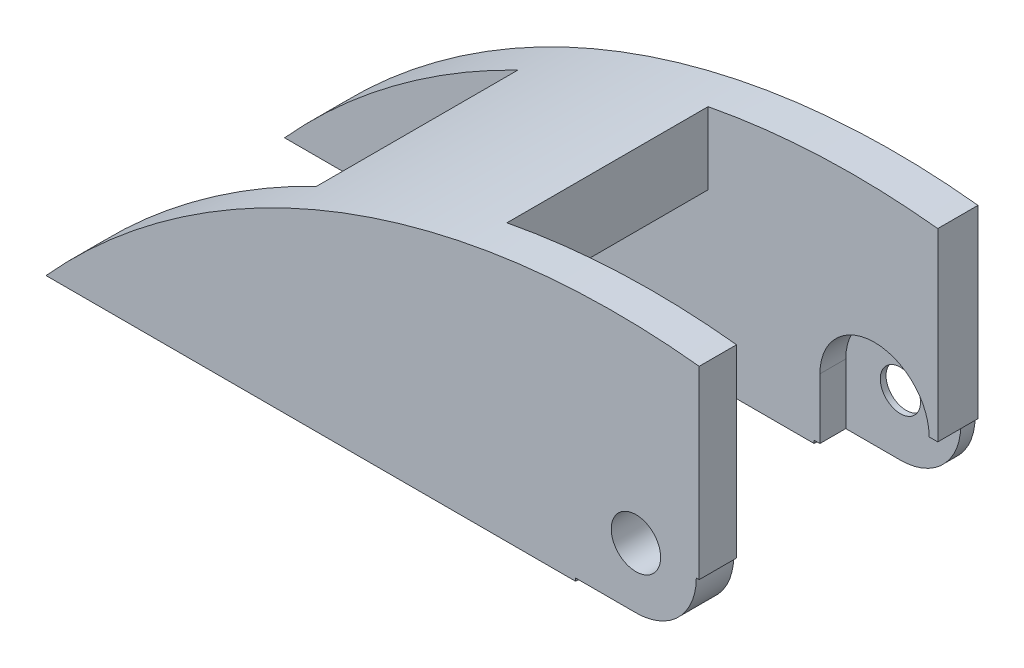
ISO-10303-21;
HEADER;
FILE_DESCRIPTION(('STEP AP214'),'2;1');
FILE_NAME('part.step','',(''),(''),'','','');
FILE_SCHEMA(('AUTOMOTIVE_DESIGN { 1 0 10303 214 1 1 1 1 }'));
ENDSEC;
DATA;
#1=APPLICATION_CONTEXT('core data for automotive mechanical design processes');
#2=APPLICATION_PROTOCOL_DEFINITION('international standard','automotive_design',2000,#1);
#3=PRODUCT_CONTEXT('',#1,'mechanical');
#4=PRODUCT('Part','Part','',(#3));
#5=PRODUCT_RELATED_PRODUCT_CATEGORY('part','',(#4));
#6=PRODUCT_DEFINITION_FORMATION('','',#4);
#7=PRODUCT_DEFINITION_CONTEXT('part definition',#1,'design');
#8=PRODUCT_DEFINITION('design','',#6,#7);
#9=PRODUCT_DEFINITION_SHAPE('','',#8);
#10=(LENGTH_UNIT() NAMED_UNIT(*) SI_UNIT(.MILLI.,.METRE.));
#11=(NAMED_UNIT(*) PLANE_ANGLE_UNIT() SI_UNIT($,.RADIAN.));
#12=(NAMED_UNIT(*) SI_UNIT($,.STERADIAN.) SOLID_ANGLE_UNIT());
#13=UNCERTAINTY_MEASURE_WITH_UNIT(LENGTH_MEASURE(1.E-05),#10,'distance_accuracy_value','');
#14=(GEOMETRIC_REPRESENTATION_CONTEXT(3) GLOBAL_UNCERTAINTY_ASSIGNED_CONTEXT((#13)) GLOBAL_UNIT_ASSIGNED_CONTEXT((#10,
#11,#12)) REPRESENTATION_CONTEXT('',''));
#15=CARTESIAN_POINT('',(0.,0.,0.));
#16=DIRECTION('',(0.,0.,1.));
#17=DIRECTION('',(1.,0.,0.));
#18=AXIS2_PLACEMENT_3D('',#15,#16,#17);
#19=CARTESIAN_POINT('',(0.,0.,0.));
#20=DIRECTION('',(0.,0.,-1.));
#21=DIRECTION('',(1.,0.,0.));
#22=AXIS2_PLACEMENT_3D('',#19,#20,#21);
#23=PLANE('',#22);
#24=DIRECTION('',(-1.,0.,0.));
#25=VECTOR('',#24,1.);
#26=CARTESIAN_POINT('',(0.,0.,0.));
#27=LINE('',#26,#25);
#28=CARTESIAN_POINT('',(11.,0.,0.));
#29=VERTEX_POINT('',#28);
#30=CARTESIAN_POINT('',(10.5,0.,0.));
#31=VERTEX_POINT('',#30);
#32=EDGE_CURVE('E313',#29,#31,#27,.T.);
#33=ORIENTED_EDGE('',*,*,#32,.T.);
#34=CARTESIAN_POINT('',(0.,0.,0.));
#35=DIRECTION('',(0.,0.,1.));
#36=DIRECTION('',(1.,0.,0.));
#37=AXIS2_PLACEMENT_3D('',#34,#35,#36);
#38=CIRCLE('',#37,10.5);
#39=CARTESIAN_POINT('',(0.,-10.5,0.));
#40=VERTEX_POINT('',#39);
#41=EDGE_CURVE('E326',#40,#31,#38,.T.);
#42=ORIENTED_EDGE('',*,*,#41,.F.);
#43=DIRECTION('',(-1.,0.,0.));
#44=VECTOR('',#43,1.);
#45=CARTESIAN_POINT('',(0.,-10.5,0.));
#46=LINE('',#45,#44);
#47=CARTESIAN_POINT('',(-10.5,-10.5,0.));
#48=VERTEX_POINT('',#47);
#49=EDGE_CURVE('E330',#40,#48,#46,.T.);
#50=ORIENTED_EDGE('',*,*,#49,.T.);
#51=DIRECTION('',(0.,-1.,0.));
#52=VECTOR('',#51,1.);
#53=CARTESIAN_POINT('',(-10.5,0.,0.));
#54=LINE('',#53,#52);
#55=CARTESIAN_POINT('',(-10.5,-11.,0.));
#56=VERTEX_POINT('',#55);
#57=EDGE_CURVE('E334',#48,#56,#54,.T.);
#58=ORIENTED_EDGE('',*,*,#57,.T.);
#59=DIRECTION('',(-1.,0.,0.));
#60=VECTOR('',#59,1.);
#61=CARTESIAN_POINT('',(0.,-11.,0.));
#62=LINE('',#61,#60);
#63=CARTESIAN_POINT('',(-102.62,-11.,0.));
#64=VERTEX_POINT('',#63);
#65=EDGE_CURVE('E433',#56,#64,#62,.T.);
#66=ORIENTED_EDGE('',*,*,#65,.T.);
#67=CARTESIAN_POINT('',(-3.65048090000549,-100.467657861413,0.));
#68=DIRECTION('',(0.,0.,1.));
#69=DIRECTION('',(-1.,0.,0.));
#70=AXIS2_PLACEMENT_3D('',#67,#68,#69);
#71=CIRCLE('',#70,133.414495142361);
#72=CARTESIAN_POINT('',(11.,32.14,0.));
#73=VERTEX_POINT('',#72);
#74=EDGE_CURVE('E390',#73,#64,#71,.T.);
#75=ORIENTED_EDGE('',*,*,#74,.F.);
#76=DIRECTION('',(0.,-1.,0.));
#77=VECTOR('',#76,1.);
#78=CARTESIAN_POINT('',(11.,0.,0.));
#79=LINE('',#78,#77);
#80=EDGE_CURVE('E442',#73,#29,#79,.T.);
#81=ORIENTED_EDGE('',*,*,#80,.T.);
#82=EDGE_LOOP('',(#33,#42,#50,#58,#66,#75,#81));
#83=FACE_BOUND('',#82,.T.);
#84=CARTESIAN_POINT('',(0.,0.,0.));
#85=DIRECTION('',(0.,0.,1.));
#86=DIRECTION('',(1.,0.,0.));
#87=AXIS2_PLACEMENT_3D('',#84,#85,#86);
#88=CIRCLE('',#87,6.);
#89=CARTESIAN_POINT('',(0.,-6.,0.));
#90=VERTEX_POINT('',#89);
#91=CARTESIAN_POINT('',(0.,6.,0.));
#92=VERTEX_POINT('',#91);
#93=EDGE_CURVE('E240',#90,#92,#88,.T.);
#94=ORIENTED_EDGE('',*,*,#93,.T.);
#95=DIRECTION('',(-1.,0.,0.));
#96=VECTOR('',#95,1.);
#97=CARTESIAN_POINT('',(0.,6.,0.));
#98=LINE('',#97,#96);
#99=CARTESIAN_POINT('',(-25.,6.,0.));
#100=VERTEX_POINT('',#99);
#101=EDGE_CURVE('E264',#92,#100,#98,.T.);
#102=ORIENTED_EDGE('',*,*,#101,.T.);
#103=DIRECTION('',(0.,-1.,0.));
#104=VECTOR('',#103,1.);
#105=CARTESIAN_POINT('',(-25.,0.,0.));
#106=LINE('',#105,#104);
#107=CARTESIAN_POINT('',(-25.,-6.,0.));
#108=VERTEX_POINT('',#107);
#109=EDGE_CURVE('E252',#100,#108,#106,.T.);
#110=ORIENTED_EDGE('',*,*,#109,.T.);
#111=DIRECTION('',(-1.,0.,0.));
#112=VECTOR('',#111,1.);
#113=CARTESIAN_POINT('',(0.,-6.,0.));
#114=LINE('',#113,#112);
#115=EDGE_CURVE('E259',#90,#108,#114,.T.);
#116=ORIENTED_EDGE('',*,*,#115,.F.);
#117=EDGE_LOOP('',(#94,#102,#110,#116));
#118=FACE_BOUND('',#117,.T.);
#119=ADVANCED_FACE('F49',(#83,#118),#23,.T.);
#120=CARTESIAN_POINT('',(0.,0.,21.75));
#121=DIRECTION('',(0.,0.,-1.));
#122=DIRECTION('',(1.,0.,0.));
#123=AXIS2_PLACEMENT_3D('',#120,#121,#122);
#124=CYLINDRICAL_SURFACE('',#123,3.5);
#125=CARTESIAN_POINT('',(0.,0.,2.5));
#126=DIRECTION('',(0.,0.,-1.));
#127=DIRECTION('',(0.,1.,0.));
#128=AXIS2_PLACEMENT_3D('',#125,#126,#127);
#129=CIRCLE('',#128,3.5);
#130=CARTESIAN_POINT('',(0.,3.5,2.5));
#131=VERTEX_POINT('',#130);
#132=EDGE_CURVE('E53',#131,#131,#129,.T.);
#133=ORIENTED_EDGE('',*,*,#132,.F.);
#134=EDGE_LOOP('',(#133));
#135=FACE_BOUND('',#134,.T.);
#136=CARTESIAN_POINT('',(0.,0.,1.5));
#137=DIRECTION('',(0.,0.,1.));
#138=DIRECTION('',(1.,0.,0.));
#139=AXIS2_PLACEMENT_3D('',#136,#137,#138);
#140=CIRCLE('',#139,3.5);
#141=CARTESIAN_POINT('',(3.5,0.,1.5));
#142=VERTEX_POINT('',#141);
#143=EDGE_CURVE('E248',#142,#142,#140,.F.);
#144=ORIENTED_EDGE('',*,*,#143,.T.);
#145=EDGE_LOOP('',(#144));
#146=FACE_BOUND('',#145,.T.);
#147=ADVANCED_FACE('F620',(#135,#146),#124,.F.);
#148=CARTESIAN_POINT('',(12.,-12.,7.));
#149=DIRECTION('',(0.,0.,-1.));
#150=DIRECTION('',(0.,-1.,0.));
#151=AXIS2_PLACEMENT_3D('',#148,#149,#150);
#152=PLANE('',#151);
#153=DIRECTION('',(-1.,0.,0.));
#154=VECTOR('',#153,1.);
#155=CARTESIAN_POINT('',(12.,0.,7.));
#156=LINE('',#155,#154);
#157=CARTESIAN_POINT('',(11.,0.,7.00000000000001));
#158=VERTEX_POINT('',#157);
#159=CARTESIAN_POINT('',(9.5,0.,7.));
#160=VERTEX_POINT('',#159);
#161=EDGE_CURVE('E365',#158,#160,#156,.T.);
#162=ORIENTED_EDGE('',*,*,#161,.F.);
#163=DIRECTION('',(0.,-1.,0.));
#164=VECTOR('',#163,1.);
#165=CARTESIAN_POINT('',(11.,-12.,7.));
#166=LINE('',#165,#164);
#167=CARTESIAN_POINT('',(11.,32.14,7.));
#168=VERTEX_POINT('',#167);
#169=EDGE_CURVE('E458',#168,#158,#166,.T.);
#170=ORIENTED_EDGE('',*,*,#169,.F.);
#171=CARTESIAN_POINT('',(-3.65048090000549,-100.467657861413,7.));
#172=DIRECTION('',(0.,0.,-1.));
#173=DIRECTION('',(-1.,0.,0.));
#174=AXIS2_PLACEMENT_3D('',#171,#172,#173);
#175=CIRCLE('',#174,133.414495142361);
#176=CARTESIAN_POINT('',(-28.9549396585655,30.5251353793884,7.));
#177=VERTEX_POINT('',#176);
#178=EDGE_CURVE('E478',#168,#177,#175,.F.);
#179=ORIENTED_EDGE('',*,*,#178,.T.);
#180=DIRECTION('',(0.,-1.,0.));
#181=VECTOR('',#180,1.);
#182=CARTESIAN_POINT('',(-28.9549396585655,38.5702227114121,7.));
#183=LINE('',#182,#181);
#184=CARTESIAN_POINT('',(-28.9549396585655,18.,7.));
#185=VERTEX_POINT('',#184);
#186=EDGE_CURVE('E369',#177,#185,#183,.T.);
#187=ORIENTED_EDGE('',*,*,#186,.T.);
#188=DIRECTION('',(1.,0.,0.));
#189=VECTOR('',#188,1.);
#190=CARTESIAN_POINT('',(0.,18.,7.));
#191=LINE('',#190,#189);
#192=CARTESIAN_POINT('',(-34.2965836217796,18.,6.99999999999999));
#193=VERTEX_POINT('',#192);
#194=EDGE_CURVE('E438',#193,#185,#191,.T.);
#195=ORIENTED_EDGE('',*,*,#194,.F.);
#196=CARTESIAN_POINT('',(11.,-91.4878048780488,6.99999999999999));
#197=DIRECTION('',(0.,0.,1.));
#198=DIRECTION('',(0.,-1.,0.));
#199=AXIS2_PLACEMENT_3D('',#196,#197,#198);
#200=CIRCLE('',#199,118.487804878049);
#201=CARTESIAN_POINT('',(-62.0435913010327,1.80739153991399,7.));
#202=VERTEX_POINT('',#201);
#203=EDGE_CURVE('E426',#193,#202,#200,.T.);
#204=ORIENTED_EDGE('',*,*,#203,.T.);
#205=DIRECTION('',(0.,1.,0.));
#206=VECTOR('',#205,1.);
#207=CARTESIAN_POINT('',(-62.0435913010327,-11.,7.));
#208=LINE('',#207,#206);
#209=CARTESIAN_POINT('',(-62.0435913010327,19.489301802395,7.));
#210=VERTEX_POINT('',#209);
#211=EDGE_CURVE('E373',#202,#210,#208,.T.);
#212=ORIENTED_EDGE('',*,*,#211,.T.);
#213=CARTESIAN_POINT('',(-3.65048090000549,-100.467657861413,7.));
#214=DIRECTION('',(0.,0.,-1.));
#215=DIRECTION('',(-1.,0.,0.));
#216=AXIS2_PLACEMENT_3D('',#213,#214,#215);
#217=CIRCLE('',#216,133.414495142361);
#218=CARTESIAN_POINT('',(-102.62,-11.,7.));
#219=VERTEX_POINT('',#218);
#220=EDGE_CURVE('E489',#210,#219,#217,.F.);
#221=ORIENTED_EDGE('',*,*,#220,.T.);
#222=DIRECTION('',(-1.,0.,0.));
#223=VECTOR('',#222,1.);
#224=CARTESIAN_POINT('',(0.,-11.,7.));
#225=LINE('',#224,#223);
#226=CARTESIAN_POINT('',(-10.5,-11.,7.00000000000001));
#227=VERTEX_POINT('',#226);
#228=EDGE_CURVE('E434',#227,#219,#225,.T.);
#229=ORIENTED_EDGE('',*,*,#228,.F.);
#230=DIRECTION('',(0.,-1.,0.));
#231=VECTOR('',#230,1.);
#232=CARTESIAN_POINT('',(-10.5,-12.,7.));
#233=LINE('',#232,#231);
#234=CARTESIAN_POINT('',(-10.5,-10.5,7.00000000000001));
#235=VERTEX_POINT('',#234);
#236=EDGE_CURVE('E361',#235,#227,#233,.T.);
#237=ORIENTED_EDGE('',*,*,#236,.F.);
#238=DIRECTION('',(-1.,0.,0.));
#239=VECTOR('',#238,1.);
#240=CARTESIAN_POINT('',(12.,-10.5,7.));
#241=LINE('',#240,#239);
#242=CARTESIAN_POINT('',(-9.5,-10.5,7.00000000000001));
#243=VERTEX_POINT('',#242);
#244=EDGE_CURVE('E344',#243,#235,#241,.T.);
#245=ORIENTED_EDGE('',*,*,#244,.F.);
#246=DIRECTION('',(0.,1.,0.));
#247=VECTOR('',#246,1.);
#248=CARTESIAN_POINT('',(-9.5,-12.,7.));
#249=LINE('',#248,#247);
#250=CARTESIAN_POINT('',(-9.5,0.,7.));
#251=VERTEX_POINT('',#250);
#252=EDGE_CURVE('E299',#243,#251,#249,.T.);
#253=ORIENTED_EDGE('',*,*,#252,.T.);
#254=CARTESIAN_POINT('',(0.,0.,7.));
#255=DIRECTION('',(0.,0.,-1.));
#256=DIRECTION('',(0.,1.,0.));
#257=AXIS2_PLACEMENT_3D('',#254,#255,#256);
#258=CIRCLE('',#257,9.5);
#259=EDGE_CURVE('E463',#251,#160,#258,.T.);
#260=ORIENTED_EDGE('',*,*,#259,.T.);
#261=EDGE_LOOP('',(#162,#170,#179,#187,#195,#204,#212,#221,#229,#237,#245,#253,#260));
#262=FACE_BOUND('',#261,.T.);
#263=ADVANCED_FACE('F558',(#262),#152,.F.);
#264=CARTESIAN_POINT('',(0.,0.,2.5));
#265=DIRECTION('',(0.,0.,1.));
#266=DIRECTION('',(0.,1.,0.));
#267=AXIS2_PLACEMENT_3D('',#264,#265,#266);
#268=CYLINDRICAL_SURFACE('',#267,9.5);
#269=DIRECTION('',(0.,0.,1.));
#270=VECTOR('',#269,1.);
#271=CARTESIAN_POINT('',(9.5,0.,2.5));
#272=LINE('',#271,#270);
#273=CARTESIAN_POINT('',(9.5,0.,2.5));
#274=VERTEX_POINT('',#273);
#275=EDGE_CURVE('E296',#274,#160,#272,.T.);
#276=ORIENTED_EDGE('',*,*,#275,.T.);
#277=ORIENTED_EDGE('',*,*,#259,.F.);
#278=DIRECTION('',(0.,0.,1.));
#279=VECTOR('',#278,1.);
#280=CARTESIAN_POINT('',(-9.5,0.,2.5));
#281=LINE('',#280,#279);
#282=CARTESIAN_POINT('',(-9.5,0.,2.5));
#283=VERTEX_POINT('',#282);
#284=EDGE_CURVE('E293',#283,#251,#281,.T.);
#285=ORIENTED_EDGE('',*,*,#284,.F.);
#286=CARTESIAN_POINT('',(0.,0.,2.5));
#287=DIRECTION('',(0.,0.,-1.));
#288=DIRECTION('',(0.,1.,0.));
#289=AXIS2_PLACEMENT_3D('',#286,#287,#288);
#290=CIRCLE('',#289,9.5);
#291=EDGE_CURVE('E462',#283,#274,#290,.T.);
#292=ORIENTED_EDGE('',*,*,#291,.T.);
#293=EDGE_LOOP('',(#276,#277,#285,#292));
#294=FACE_BOUND('',#293,.T.);
#295=ADVANCED_FACE('F616',(#294),#268,.F.);
#296=CARTESIAN_POINT('',(0.,-10.5,48.5));
#297=DIRECTION('',(0.,1.,0.));
#298=DIRECTION('',(0.,0.,-1.));
#299=AXIS2_PLACEMENT_3D('',#296,#297,#298);
#300=PLANE('',#299);
#301=DIRECTION('',(0.,0.,1.));
#302=VECTOR('',#301,1.);
#303=CARTESIAN_POINT('',(-9.5,-10.5,2.5));
#304=LINE('',#303,#302);
#305=CARTESIAN_POINT('',(-9.5,-10.5,2.5));
#306=VERTEX_POINT('',#305);
#307=EDGE_CURVE('E290',#306,#243,#304,.T.);
#308=ORIENTED_EDGE('',*,*,#307,.T.);
#309=ORIENTED_EDGE('',*,*,#244,.T.);
#310=DIRECTION('',(0.,0.,-1.));
#311=VECTOR('',#310,1.);
#312=CARTESIAN_POINT('',(-10.5,-10.5,48.5));
#313=LINE('',#312,#311);
#314=EDGE_CURVE('E354',#235,#48,#313,.T.);
#315=ORIENTED_EDGE('',*,*,#314,.T.);
#316=ORIENTED_EDGE('',*,*,#49,.F.);
#317=DIRECTION('',(0.,0.,-1.));
#318=VECTOR('',#317,1.);
#319=CARTESIAN_POINT('',(0.,-10.5,48.5));
#320=LINE('',#319,#318);
#321=CARTESIAN_POINT('',(0.,-10.5,2.50000000000002));
#322=VERTEX_POINT('',#321);
#323=EDGE_CURVE('E325',#322,#40,#320,.T.);
#324=ORIENTED_EDGE('',*,*,#323,.F.);
#325=DIRECTION('',(-1.,0.,0.));
#326=VECTOR('',#325,1.);
#327=CARTESIAN_POINT('',(0.,-10.5,2.5));
#328=LINE('',#327,#326);
#329=EDGE_CURVE('E278',#322,#306,#328,.T.);
#330=ORIENTED_EDGE('',*,*,#329,.T.);
#331=EDGE_LOOP('',(#308,#309,#315,#316,#324,#330));
#332=FACE_BOUND('',#331,.T.);
#333=ADVANCED_FACE('F574',(#332),#300,.F.);
#334=CARTESIAN_POINT('',(12.,18.,7.));
#335=DIRECTION('',(0.,1.,0.));
#336=DIRECTION('',(0.,0.,-1.));
#337=AXIS2_PLACEMENT_3D('',#334,#335,#336);
#338=PLANE('',#337);
#339=DIRECTION('',(0.,0.,1.));
#340=VECTOR('',#339,1.);
#341=CARTESIAN_POINT('',(-28.9549396585655,18.,7.));
#342=LINE('',#341,#340);
#343=CARTESIAN_POINT('',(-28.9549396585655,18.,42.));
#344=VERTEX_POINT('',#343);
#345=EDGE_CURVE('E378',#185,#344,#342,.T.);
#346=ORIENTED_EDGE('',*,*,#345,.T.);
#347=DIRECTION('',(-1.,0.,0.));
#348=VECTOR('',#347,1.);
#349=CARTESIAN_POINT('',(0.,18.,42.));
#350=LINE('',#349,#348);
#351=CARTESIAN_POINT('',(-34.2965836217796,18.,42.));
#352=VERTEX_POINT('',#351);
#353=EDGE_CURVE('E411',#344,#352,#350,.T.);
#354=ORIENTED_EDGE('',*,*,#353,.T.);
#355=DIRECTION('',(0.,0.,-1.));
#356=VECTOR('',#355,1.);
#357=CARTESIAN_POINT('',(-34.2965836217796,18.,41.5));
#358=LINE('',#357,#356);
#359=EDGE_CURVE('E423',#352,#193,#358,.T.);
#360=ORIENTED_EDGE('',*,*,#359,.T.);
#361=ORIENTED_EDGE('',*,*,#194,.T.);
#362=EDGE_LOOP('',(#346,#354,#360,#361));
#363=FACE_BOUND('',#362,.T.);
#364=ADVANCED_FACE('F608',(#363),#338,.F.);
#365=CARTESIAN_POINT('',(11.,0.,48.5));
#366=DIRECTION('',(-1.,0.,0.));
#367=DIRECTION('',(0.,0.,-1.));
#368=AXIS2_PLACEMENT_3D('',#365,#366,#367);
#369=PLANE('',#368);
#370=ORIENTED_EDGE('',*,*,#169,.T.);
#371=DIRECTION('',(0.,0.,-1.));
#372=VECTOR('',#371,1.);
#373=CARTESIAN_POINT('',(11.,0.,48.5));
#374=LINE('',#373,#372);
#375=EDGE_CURVE('E450',#158,#29,#374,.T.);
#376=ORIENTED_EDGE('',*,*,#375,.T.);
#377=ORIENTED_EDGE('',*,*,#80,.F.);
#378=DIRECTION('',(0.,0.,-1.));
#379=VECTOR('',#378,1.);
#380=CARTESIAN_POINT('',(11.,32.14,48.5));
#381=LINE('',#380,#379);
#382=EDGE_CURVE('E404',#168,#73,#381,.T.);
#383=ORIENTED_EDGE('',*,*,#382,.F.);
#384=EDGE_LOOP('',(#370,#376,#377,#383));
#385=FACE_BOUND('',#384,.T.);
#386=ADVANCED_FACE('F560',(#385),#369,.F.);
#387=CARTESIAN_POINT('',(0.,-11.,7.));
#388=DIRECTION('',(0.,1.,0.));
#389=DIRECTION('',(-1.,0.,0.));
#390=AXIS2_PLACEMENT_3D('',#387,#388,#389);
#391=PLANE('',#390);
#392=ORIENTED_EDGE('',*,*,#228,.T.);
#393=DIRECTION('',(0.,0.,-1.));
#394=VECTOR('',#393,1.);
#395=CARTESIAN_POINT('',(-102.62,-11.,48.5));
#396=LINE('',#395,#394);
#397=EDGE_CURVE('E398',#219,#64,#396,.T.);
#398=ORIENTED_EDGE('',*,*,#397,.T.);
#399=ORIENTED_EDGE('',*,*,#65,.F.);
#400=DIRECTION('',(0.,0.,-1.));
#401=VECTOR('',#400,1.);
#402=CARTESIAN_POINT('',(-10.5,-11.,48.5));
#403=LINE('',#402,#401);
#404=EDGE_CURVE('E350',#227,#56,#403,.T.);
#405=ORIENTED_EDGE('',*,*,#404,.F.);
#406=EDGE_LOOP('',(#392,#398,#399,#405));
#407=FACE_BOUND('',#406,.T.);
#408=ADVANCED_FACE('F596',(#407),#391,.F.);
#409=CARTESIAN_POINT('',(11.,-91.4878048780488,41.5));
#410=DIRECTION('',(0.,0.,-1.));
#411=DIRECTION('',(1.,0.,0.));
#412=AXIS2_PLACEMENT_3D('',#409,#410,#411);
#413=CYLINDRICAL_SURFACE('',#412,118.487804878049);
#414=DIRECTION('',(0.,0.,-1.));
#415=VECTOR('',#414,1.);
#416=CARTESIAN_POINT('',(-62.0435913010327,1.80739153991399,41.5));
#417=LINE('',#416,#415);
#418=CARTESIAN_POINT('',(-62.0435913010327,1.80739153991399,42.));
#419=VERTEX_POINT('',#418);
#420=EDGE_CURVE('E387',#419,#202,#417,.T.);
#421=ORIENTED_EDGE('',*,*,#420,.T.);
#422=ORIENTED_EDGE('',*,*,#203,.F.);
#423=ORIENTED_EDGE('',*,*,#359,.F.);
#424=CARTESIAN_POINT('',(11.,-91.4878048780488,42.));
#425=DIRECTION('',(0.,0.,1.));
#426=DIRECTION('',(1.,0.,0.));
#427=AXIS2_PLACEMENT_3D('',#424,#425,#426);
#428=CIRCLE('',#427,118.487804878049);
#429=EDGE_CURVE('E415',#352,#419,#428,.T.);
#430=ORIENTED_EDGE('',*,*,#429,.T.);
#431=EDGE_LOOP('',(#421,#422,#423,#430));
#432=FACE_BOUND('',#431,.T.);
#433=ADVANCED_FACE('F606',(#432),#413,.F.);
#434=CARTESIAN_POINT('',(-3.65048090000549,-100.467657861413,48.5));
#435=DIRECTION('',(0.,0.,-1.));
#436=DIRECTION('',(1.,0.,0.));
#437=AXIS2_PLACEMENT_3D('',#434,#435,#436);
#438=CYLINDRICAL_SURFACE('',#437,133.414495142361);
#439=DIRECTION('',(0.,0.,-1.));
#440=VECTOR('',#439,1.);
#441=CARTESIAN_POINT('',(-62.0435913010327,19.489301802395,48.5));
#442=LINE('',#441,#440);
#443=CARTESIAN_POINT('',(-62.0435913010327,19.489301802395,42.));
#444=VERTEX_POINT('',#443);
#445=EDGE_CURVE('E486',#444,#210,#442,.T.);
#446=ORIENTED_EDGE('',*,*,#445,.F.);
#447=CARTESIAN_POINT('',(-3.65048090000549,-100.467657861413,42.));
#448=DIRECTION('',(0.,0.,-1.));
#449=DIRECTION('',(-1.,0.,0.));
#450=AXIS2_PLACEMENT_3D('',#447,#448,#449);
#451=CIRCLE('',#450,133.414495142361);
#452=CARTESIAN_POINT('',(-102.62,-11.,42.));
#453=VERTEX_POINT('',#452);
#454=EDGE_CURVE('E482',#444,#453,#451,.F.);
#455=ORIENTED_EDGE('',*,*,#454,.T.);
#456=CARTESIAN_POINT('',(-102.62,-11.,48.5));
#457=VERTEX_POINT('',#456);
#458=EDGE_CURVE('E405',#457,#453,#396,.T.);
#459=ORIENTED_EDGE('',*,*,#458,.F.);
#460=CARTESIAN_POINT('',(-3.65048090000549,-100.467657861413,48.5));
#461=DIRECTION('',(0.,0.,1.));
#462=DIRECTION('',(-1.,0.,0.));
#463=AXIS2_PLACEMENT_3D('',#460,#461,#462);
#464=CIRCLE('',#463,133.414495142361);
#465=CARTESIAN_POINT('',(11.,32.14,48.5));
#466=VERTEX_POINT('',#465);
#467=EDGE_CURVE('E394',#466,#457,#464,.T.);
#468=ORIENTED_EDGE('',*,*,#467,.F.);
#469=CARTESIAN_POINT('',(11.,32.14,42.));
#470=VERTEX_POINT('',#469);
#471=EDGE_CURVE('E399',#466,#470,#381,.T.);
#472=ORIENTED_EDGE('',*,*,#471,.T.);
#473=CARTESIAN_POINT('',(-3.65048090000549,-100.467657861413,42.));
#474=DIRECTION('',(0.,0.,-1.));
#475=DIRECTION('',(-1.,0.,0.));
#476=AXIS2_PLACEMENT_3D('',#473,#474,#475);
#477=CIRCLE('',#476,133.414495142361);
#478=CARTESIAN_POINT('',(-28.9549396585655,30.5251353793884,42.));
#479=VERTEX_POINT('',#478);
#480=EDGE_CURVE('E467',#470,#479,#477,.F.);
#481=ORIENTED_EDGE('',*,*,#480,.T.);
#482=DIRECTION('',(0.,0.,-1.));
#483=VECTOR('',#482,1.);
#484=CARTESIAN_POINT('',(-28.9549396585655,30.5251353793883,48.5));
#485=LINE('',#484,#483);
#486=EDGE_CURVE('E474',#177,#479,#485,.F.);
#487=ORIENTED_EDGE('',*,*,#486,.F.);
#488=ORIENTED_EDGE('',*,*,#178,.F.);
#489=ORIENTED_EDGE('',*,*,#382,.T.);
#490=ORIENTED_EDGE('',*,*,#74,.T.);
#491=ORIENTED_EDGE('',*,*,#397,.F.);
#492=ORIENTED_EDGE('',*,*,#220,.F.);
#493=EDGE_LOOP('',(#446,#455,#459,#468,#472,#481,#487,#488,#489,#490,#491,#492));
#494=FACE_BOUND('',#493,.T.);
#495=ADVANCED_FACE('F520',(#494),#438,.T.);
#496=CARTESIAN_POINT('',(0.,0.,48.5));
#497=DIRECTION('',(0.,0.,1.));
#498=DIRECTION('',(-1.,0.,0.));
#499=AXIS2_PLACEMENT_3D('',#496,#497,#498);
#500=PLANE('',#499);
#501=CARTESIAN_POINT('',(0.,0.,48.5));
#502=DIRECTION('',(0.,0.,1.));
#503=DIRECTION('',(1.,0.,0.));
#504=AXIS2_PLACEMENT_3D('',#501,#502,#503);
#505=CIRCLE('',#504,4.3);
#506=CARTESIAN_POINT('',(4.3,0.,48.5));
#507=VERTEX_POINT('',#506);
#508=EDGE_CURVE('E303',#507,#507,#505,.T.);
#509=ORIENTED_EDGE('',*,*,#508,.F.);
#510=EDGE_LOOP('',(#509));
#511=FACE_BOUND('',#510,.T.);
#512=DIRECTION('',(-1.,0.,0.));
#513=VECTOR('',#512,1.);
#514=CARTESIAN_POINT('',(0.,0.,48.5));
#515=LINE('',#514,#513);
#516=CARTESIAN_POINT('',(11.,0.,48.5));
#517=VERTEX_POINT('',#516);
#518=CARTESIAN_POINT('',(10.5,0.,48.5));
#519=VERTEX_POINT('',#518);
#520=EDGE_CURVE('E321',#517,#519,#515,.T.);
#521=ORIENTED_EDGE('',*,*,#520,.F.);
#522=DIRECTION('',(0.,-1.,0.));
#523=VECTOR('',#522,1.);
#524=CARTESIAN_POINT('',(11.,0.,48.5));
#525=LINE('',#524,#523);
#526=EDGE_CURVE('E446',#466,#517,#525,.T.);
#527=ORIENTED_EDGE('',*,*,#526,.F.);
#528=ORIENTED_EDGE('',*,*,#467,.T.);
#529=DIRECTION('',(-1.,0.,0.));
#530=VECTOR('',#529,1.);
#531=CARTESIAN_POINT('',(0.,-11.,48.5));
#532=LINE('',#531,#530);
#533=CARTESIAN_POINT('',(-10.5,-11.,48.5));
#534=VERTEX_POINT('',#533);
#535=EDGE_CURVE('E430',#534,#457,#532,.T.);
#536=ORIENTED_EDGE('',*,*,#535,.F.);
#537=DIRECTION('',(0.,-1.,0.));
#538=VECTOR('',#537,1.);
#539=CARTESIAN_POINT('',(-10.5,0.,48.5));
#540=LINE('',#539,#538);
#541=CARTESIAN_POINT('',(-10.5,-10.5,48.5));
#542=VERTEX_POINT('',#541);
#543=EDGE_CURVE('E317',#542,#534,#540,.T.);
#544=ORIENTED_EDGE('',*,*,#543,.F.);
#545=DIRECTION('',(-1.,0.,0.));
#546=VECTOR('',#545,1.);
#547=CARTESIAN_POINT('',(0.,-10.5,48.5));
#548=LINE('',#547,#546);
#549=CARTESIAN_POINT('',(0.,-10.5,48.5));
#550=VERTEX_POINT('',#549);
#551=EDGE_CURVE('E312',#550,#542,#548,.T.);
#552=ORIENTED_EDGE('',*,*,#551,.F.);
#553=CARTESIAN_POINT('',(0.,0.,48.5));
#554=DIRECTION('',(0.,0.,1.));
#555=DIRECTION('',(1.,0.,0.));
#556=AXIS2_PLACEMENT_3D('',#553,#554,#555);
#557=CIRCLE('',#556,10.5);
#558=EDGE_CURVE('E308',#550,#519,#557,.T.);
#559=ORIENTED_EDGE('',*,*,#558,.T.);
#560=EDGE_LOOP('',(#521,#527,#528,#536,#544,#552,#559));
#561=FACE_BOUND('',#560,.T.);
#562=ADVANCED_FACE('F517',(#511,#561),#500,.T.);
#563=CARTESIAN_POINT('',(0.,0.,2.5));
#564=DIRECTION('',(0.,0.,1.));
#565=DIRECTION('',(0.,1.,0.));
#566=AXIS2_PLACEMENT_3D('',#563,#564,#565);
#567=PLANE('',#566);
#568=ORIENTED_EDGE('',*,*,#132,.T.);
#569=EDGE_LOOP('',(#568));
#570=FACE_BOUND('',#569,.T.);
#571=ORIENTED_EDGE('',*,*,#291,.F.);
#572=DIRECTION('',(0.,-1.,0.));
#573=VECTOR('',#572,1.);
#574=CARTESIAN_POINT('',(-9.5,0.,2.5));
#575=LINE('',#574,#573);
#576=EDGE_CURVE('E287',#283,#306,#575,.T.);
#577=ORIENTED_EDGE('',*,*,#576,.T.);
#578=ORIENTED_EDGE('',*,*,#329,.F.);
#579=CARTESIAN_POINT('',(0.,0.,2.5));
#580=DIRECTION('',(0.,0.,1.));
#581=DIRECTION('',(1.,0.,0.));
#582=AXIS2_PLACEMENT_3D('',#579,#580,#581);
#583=CIRCLE('',#582,10.5);
#584=CARTESIAN_POINT('',(10.5,0.,2.5));
#585=VERTEX_POINT('',#584);
#586=EDGE_CURVE('E75',#322,#585,#583,.T.);
#587=ORIENTED_EDGE('',*,*,#586,.T.);
#588=DIRECTION('',(-1.,0.,0.));
#589=VECTOR('',#588,1.);
#590=CARTESIAN_POINT('',(0.,0.,2.5));
#591=LINE('',#590,#589);
#592=EDGE_CURVE('E284',#585,#274,#591,.T.);
#593=ORIENTED_EDGE('',*,*,#592,.T.);
#594=EDGE_LOOP('',(#571,#577,#578,#587,#593));
#595=FACE_BOUND('',#594,.T.);
#596=ADVANCED_FACE('F51',(#570,#595),#567,.T.);
#597=ORIENTED_EDGE('',*,*,#471,.F.);
#598=ORIENTED_EDGE('',*,*,#526,.T.);
#599=CARTESIAN_POINT('',(11.,0.,42.));
#600=VERTEX_POINT('',#599);
#601=EDGE_CURVE('E454',#517,#600,#374,.T.);
#602=ORIENTED_EDGE('',*,*,#601,.T.);
#603=DIRECTION('',(0.,1.,0.));
#604=VECTOR('',#603,1.);
#605=CARTESIAN_POINT('',(11.,0.,42.));
#606=LINE('',#605,#604);
#607=EDGE_CURVE('E403',#600,#470,#606,.T.);
#608=ORIENTED_EDGE('',*,*,#607,.T.);
#609=EDGE_LOOP('',(#597,#598,#602,#608));
#610=FACE_BOUND('',#609,.T.);
#611=ADVANCED_FACE('F530',(#610),#369,.F.);
#612=ORIENTED_EDGE('',*,*,#535,.T.);
#613=ORIENTED_EDGE('',*,*,#458,.T.);
#614=DIRECTION('',(1.,0.,0.));
#615=VECTOR('',#614,1.);
#616=CARTESIAN_POINT('',(0.,-11.,42.));
#617=LINE('',#616,#615);
#618=CARTESIAN_POINT('',(-10.5,-11.,42.));
#619=VERTEX_POINT('',#618);
#620=EDGE_CURVE('E419',#453,#619,#617,.T.);
#621=ORIENTED_EDGE('',*,*,#620,.T.);
#622=EDGE_CURVE('E346',#534,#619,#403,.T.);
#623=ORIENTED_EDGE('',*,*,#622,.F.);
#624=EDGE_LOOP('',(#612,#613,#621,#623));
#625=FACE_BOUND('',#624,.T.);
#626=ADVANCED_FACE('F539',(#625),#391,.F.);
#627=CARTESIAN_POINT('',(0.,0.,42.));
#628=DIRECTION('',(0.,0.,-1.));
#629=DIRECTION('',(1.,0.,0.));
#630=AXIS2_PLACEMENT_3D('',#627,#628,#629);
#631=PLANE('',#630);
#632=CARTESIAN_POINT('',(0.,0.,42.));
#633=DIRECTION('',(0.,0.,1.));
#634=DIRECTION('',(1.,0.,0.));
#635=AXIS2_PLACEMENT_3D('',#632,#633,#634);
#636=CIRCLE('',#635,4.3);
#637=CARTESIAN_POINT('',(4.3,0.,42.));
#638=VERTEX_POINT('',#637);
#639=EDGE_CURVE('E307',#638,#638,#636,.T.);
#640=ORIENTED_EDGE('',*,*,#639,.T.);
#641=EDGE_LOOP('',(#640));
#642=FACE_BOUND('',#641,.T.);
#643=DIRECTION('',(-1.,0.,0.));
#644=VECTOR('',#643,1.);
#645=CARTESIAN_POINT('',(0.,0.,42.));
#646=LINE('',#645,#644);
#647=CARTESIAN_POINT('',(10.5,0.,42.));
#648=VERTEX_POINT('',#647);
#649=EDGE_CURVE('E11',#600,#648,#646,.T.);
#650=ORIENTED_EDGE('',*,*,#649,.T.);
#651=CARTESIAN_POINT('',(0.,0.,42.));
#652=DIRECTION('',(0.,0.,1.));
#653=DIRECTION('',(1.,0.,0.));
#654=AXIS2_PLACEMENT_3D('',#651,#652,#653);
#655=CIRCLE('',#654,10.5);
#656=CARTESIAN_POINT('',(0.,-10.5,42.));
#657=VERTEX_POINT('',#656);
#658=EDGE_CURVE('E59',#657,#648,#655,.T.);
#659=ORIENTED_EDGE('',*,*,#658,.F.);
#660=DIRECTION('',(-1.,0.,0.));
#661=VECTOR('',#660,1.);
#662=CARTESIAN_POINT('',(0.,-10.5,42.));
#663=LINE('',#662,#661);
#664=CARTESIAN_POINT('',(-10.5,-10.5,42.));
#665=VERTEX_POINT('',#664);
#666=EDGE_CURVE('E493',#657,#665,#663,.T.);
#667=ORIENTED_EDGE('',*,*,#666,.T.);
#668=DIRECTION('',(0.,-1.,0.));
#669=VECTOR('',#668,1.);
#670=CARTESIAN_POINT('',(-10.5,0.,42.));
#671=LINE('',#670,#669);
#672=EDGE_CURVE('E497',#665,#619,#671,.T.);
#673=ORIENTED_EDGE('',*,*,#672,.T.);
#674=ORIENTED_EDGE('',*,*,#620,.F.);
#675=ORIENTED_EDGE('',*,*,#454,.F.);
#676=DIRECTION('',(0.,1.,0.));
#677=VECTOR('',#676,1.);
#678=CARTESIAN_POINT('',(-62.0435913010327,-11.,42.));
#679=LINE('',#678,#677);
#680=EDGE_CURVE('E370',#419,#444,#679,.T.);
#681=ORIENTED_EDGE('',*,*,#680,.F.);
#682=ORIENTED_EDGE('',*,*,#429,.F.);
#683=ORIENTED_EDGE('',*,*,#353,.F.);
#684=DIRECTION('',(0.,-1.,0.));
#685=VECTOR('',#684,1.);
#686=CARTESIAN_POINT('',(-28.9549396585655,38.5702227114121,42.));
#687=LINE('',#686,#685);
#688=EDGE_CURVE('E374',#479,#344,#687,.T.);
#689=ORIENTED_EDGE('',*,*,#688,.F.);
#690=ORIENTED_EDGE('',*,*,#480,.F.);
#691=ORIENTED_EDGE('',*,*,#607,.F.);
#692=EDGE_LOOP('',(#650,#659,#667,#673,#674,#675,#681,#682,#683,#689,#690,#691));
#693=FACE_BOUND('',#692,.T.);
#694=ADVANCED_FACE('F506',(#642,#693),#631,.T.);
#695=CARTESIAN_POINT('',(-28.9549396585655,38.5702227114121,7.));
#696=DIRECTION('',(1.,0.,0.));
#697=DIRECTION('',(0.,0.,1.));
#698=AXIS2_PLACEMENT_3D('',#695,#696,#697);
#699=PLANE('',#698);
#700=ORIENTED_EDGE('',*,*,#345,.F.);
#701=ORIENTED_EDGE('',*,*,#186,.F.);
#702=ORIENTED_EDGE('',*,*,#486,.T.);
#703=ORIENTED_EDGE('',*,*,#688,.T.);
#704=EDGE_LOOP('',(#700,#701,#702,#703));
#705=FACE_BOUND('',#704,.T.);
#706=ADVANCED_FACE('F554',(#705),#699,.T.);
#707=CARTESIAN_POINT('',(-62.0435913010327,-11.,7.));
#708=DIRECTION('',(-1.,0.,0.));
#709=DIRECTION('',(0.,0.,-1.));
#710=AXIS2_PLACEMENT_3D('',#707,#708,#709);
#711=PLANE('',#710);
#712=ORIENTED_EDGE('',*,*,#420,.F.);
#713=ORIENTED_EDGE('',*,*,#680,.T.);
#714=ORIENTED_EDGE('',*,*,#445,.T.);
#715=ORIENTED_EDGE('',*,*,#211,.F.);
#716=EDGE_LOOP('',(#712,#713,#714,#715));
#717=FACE_BOUND('',#716,.T.);
#718=ADVANCED_FACE('F602',(#717),#711,.T.);
#719=CARTESIAN_POINT('',(0.,0.,48.5));
#720=DIRECTION('',(0.,1.,0.));
#721=DIRECTION('',(0.,0.,-1.));
#722=AXIS2_PLACEMENT_3D('',#719,#720,#721);
#723=PLANE('',#722);
#724=ORIENTED_EDGE('',*,*,#649,.F.);
#725=ORIENTED_EDGE('',*,*,#601,.F.);
#726=ORIENTED_EDGE('',*,*,#520,.T.);
#727=DIRECTION('',(0.,0.,-1.));
#728=VECTOR('',#727,1.);
#729=CARTESIAN_POINT('',(10.5,0.,48.5));
#730=LINE('',#729,#728);
#731=EDGE_CURVE('E341',#519,#648,#730,.T.);
#732=ORIENTED_EDGE('',*,*,#731,.T.);
#733=EDGE_LOOP('',(#724,#725,#726,#732));
#734=FACE_BOUND('',#733,.T.);
#735=ADVANCED_FACE('F527',(#734),#723,.F.);
#736=ORIENTED_EDGE('',*,*,#666,.F.);
#737=EDGE_CURVE('E355',#550,#657,#320,.T.);
#738=ORIENTED_EDGE('',*,*,#737,.F.);
#739=ORIENTED_EDGE('',*,*,#551,.T.);
#740=EDGE_CURVE('E351',#542,#665,#313,.T.);
#741=ORIENTED_EDGE('',*,*,#740,.T.);
#742=EDGE_LOOP('',(#736,#738,#739,#741));
#743=FACE_BOUND('',#742,.T.);
#744=ADVANCED_FACE('F545',(#743),#300,.F.);
#745=CARTESIAN_POINT('',(-10.5,0.,48.5));
#746=DIRECTION('',(-1.,0.,0.));
#747=DIRECTION('',(0.,0.,-1.));
#748=AXIS2_PLACEMENT_3D('',#745,#746,#747);
#749=PLANE('',#748);
#750=ORIENTED_EDGE('',*,*,#672,.F.);
#751=ORIENTED_EDGE('',*,*,#740,.F.);
#752=ORIENTED_EDGE('',*,*,#543,.T.);
#753=ORIENTED_EDGE('',*,*,#622,.T.);
#754=EDGE_LOOP('',(#750,#751,#752,#753));
#755=FACE_BOUND('',#754,.T.);
#756=ADVANCED_FACE('F542',(#755),#749,.F.);
#757=CARTESIAN_POINT('',(0.,0.,48.5));
#758=DIRECTION('',(0.,0.,-1.));
#759=DIRECTION('',(1.,0.,0.));
#760=AXIS2_PLACEMENT_3D('',#757,#758,#759);
#761=CYLINDRICAL_SURFACE('',#760,10.5);
#762=ORIENTED_EDGE('',*,*,#737,.T.);
#763=ORIENTED_EDGE('',*,*,#658,.T.);
#764=ORIENTED_EDGE('',*,*,#731,.F.);
#765=ORIENTED_EDGE('',*,*,#558,.F.);
#766=EDGE_LOOP('',(#762,#763,#764,#765));
#767=FACE_BOUND('',#766,.T.);
#768=ADVANCED_FACE('F548',(#767),#761,.T.);
#769=ORIENTED_EDGE('',*,*,#586,.F.);
#770=ORIENTED_EDGE('',*,*,#323,.T.);
#771=ORIENTED_EDGE('',*,*,#41,.T.);
#772=EDGE_CURVE('E345',#585,#31,#730,.T.);
#773=ORIENTED_EDGE('',*,*,#772,.F.);
#774=EDGE_LOOP('',(#769,#770,#771,#773));
#775=FACE_BOUND('',#774,.T.);
#776=ADVANCED_FACE('F571',(#775),#761,.T.);
#777=ORIENTED_EDGE('',*,*,#375,.F.);
#778=ORIENTED_EDGE('',*,*,#161,.T.);
#779=ORIENTED_EDGE('',*,*,#275,.F.);
#780=ORIENTED_EDGE('',*,*,#592,.F.);
#781=ORIENTED_EDGE('',*,*,#772,.T.);
#782=ORIENTED_EDGE('',*,*,#32,.F.);
#783=EDGE_LOOP('',(#777,#778,#779,#780,#781,#782));
#784=FACE_BOUND('',#783,.T.);
#785=ADVANCED_FACE('F580',(#784),#723,.F.);
#786=ORIENTED_EDGE('',*,*,#314,.F.);
#787=ORIENTED_EDGE('',*,*,#236,.T.);
#788=ORIENTED_EDGE('',*,*,#404,.T.);
#789=ORIENTED_EDGE('',*,*,#57,.F.);
#790=EDGE_LOOP('',(#786,#787,#788,#789));
#791=FACE_BOUND('',#790,.T.);
#792=ADVANCED_FACE('F513',(#791),#749,.F.);
#793=CARTESIAN_POINT('',(0.,0.,48.5));
#794=DIRECTION('',(0.,0.,-1.));
#795=DIRECTION('',(1.,0.,0.));
#796=AXIS2_PLACEMENT_3D('',#793,#794,#795);
#797=CYLINDRICAL_SURFACE('',#796,4.3);
#798=CARTESIAN_POINT('',(4.3,0.,42.));
#799=CARTESIAN_POINT('',(4.3,0.,42.0677083333333));
#800=CARTESIAN_POINT('',(4.3,0.,42.1354166666667));
#801=CARTESIAN_POINT('',(4.3,0.,42.2708333333333));
#802=CARTESIAN_POINT('',(4.3,0.,42.3385416666667));
#803=CARTESIAN_POINT('',(4.3,0.,42.4739583333333));
#804=CARTESIAN_POINT('',(4.3,0.,42.5416666666667));
#805=CARTESIAN_POINT('',(4.3,0.,42.6770833333333));
#806=CARTESIAN_POINT('',(4.3,0.,42.7447916666667));
#807=CARTESIAN_POINT('',(4.3,0.,42.8802083333333));
#808=CARTESIAN_POINT('',(4.3,0.,42.9479166666667));
#809=CARTESIAN_POINT('',(4.3,0.,43.0833333333333));
#810=CARTESIAN_POINT('',(4.3,0.,43.1510416666667));
#811=CARTESIAN_POINT('',(4.3,0.,43.2864583333333));
#812=CARTESIAN_POINT('',(4.3,0.,43.3541666666667));
#813=CARTESIAN_POINT('',(4.3,0.,43.4895833333333));
#814=CARTESIAN_POINT('',(4.3,0.,43.5572916666667));
#815=CARTESIAN_POINT('',(4.3,0.,43.6927083333333));
#816=CARTESIAN_POINT('',(4.3,0.,43.7604166666667));
#817=CARTESIAN_POINT('',(4.3,0.,43.8958333333333));
#818=CARTESIAN_POINT('',(4.3,0.,43.9635416666667));
#819=CARTESIAN_POINT('',(4.3,0.,44.0989583333333));
#820=CARTESIAN_POINT('',(4.3,0.,44.1666666666667));
#821=CARTESIAN_POINT('',(4.3,0.,44.3020833333333));
#822=CARTESIAN_POINT('',(4.3,0.,44.3697916666667));
#823=CARTESIAN_POINT('',(4.3,0.,44.5052083333333));
#824=CARTESIAN_POINT('',(4.3,0.,44.5729166666667));
#825=CARTESIAN_POINT('',(4.3,0.,44.7083333333333));
#826=CARTESIAN_POINT('',(4.3,0.,44.7760416666667));
#827=CARTESIAN_POINT('',(4.3,0.,44.9114583333333));
#828=CARTESIAN_POINT('',(4.3,0.,44.9791666666667));
#829=CARTESIAN_POINT('',(4.3,0.,45.1145833333333));
#830=CARTESIAN_POINT('',(4.3,0.,45.1822916666667));
#831=CARTESIAN_POINT('',(4.3,0.,45.3177083333333));
#832=CARTESIAN_POINT('',(4.3,0.,45.3854166666667));
#833=CARTESIAN_POINT('',(4.3,0.,45.5208333333333));
#834=CARTESIAN_POINT('',(4.3,0.,45.5885416666667));
#835=CARTESIAN_POINT('',(4.3,0.,45.7239583333333));
#836=CARTESIAN_POINT('',(4.3,0.,45.7916666666667));
#837=CARTESIAN_POINT('',(4.3,0.,45.9270833333333));
#838=CARTESIAN_POINT('',(4.3,0.,45.9947916666667));
#839=CARTESIAN_POINT('',(4.3,0.,46.1302083333333));
#840=CARTESIAN_POINT('',(4.3,0.,46.1979166666667));
#841=CARTESIAN_POINT('',(4.3,0.,46.3333333333333));
#842=CARTESIAN_POINT('',(4.3,0.,46.4010416666667));
#843=CARTESIAN_POINT('',(4.3,0.,46.5364583333333));
#844=CARTESIAN_POINT('',(4.3,0.,46.6041666666667));
#845=CARTESIAN_POINT('',(4.3,0.,46.7395833333333));
#846=CARTESIAN_POINT('',(4.3,0.,46.8072916666667));
#847=CARTESIAN_POINT('',(4.3,0.,46.9427083333333));
#848=CARTESIAN_POINT('',(4.3,0.,47.0104166666667));
#849=CARTESIAN_POINT('',(4.3,0.,47.1458333333333));
#850=CARTESIAN_POINT('',(4.3,0.,47.2135416666667));
#851=CARTESIAN_POINT('',(4.3,0.,47.3489583333333));
#852=CARTESIAN_POINT('',(4.3,0.,47.4166666666667));
#853=CARTESIAN_POINT('',(4.3,0.,47.5520833333333));
#854=CARTESIAN_POINT('',(4.3,0.,47.6197916666667));
#855=CARTESIAN_POINT('',(4.3,0.,47.7552083333333));
#856=CARTESIAN_POINT('',(4.3,0.,47.8229166666667));
#857=CARTESIAN_POINT('',(4.3,0.,47.9583333333333));
#858=CARTESIAN_POINT('',(4.3,0.,48.0260416666667));
#859=CARTESIAN_POINT('',(4.3,0.,48.1614583333333));
#860=CARTESIAN_POINT('',(4.3,0.,48.2291666666667));
#861=CARTESIAN_POINT('',(4.3,0.,48.3645833333333));
#862=CARTESIAN_POINT('',(4.3,0.,48.4322916666667));
#863=CARTESIAN_POINT('',(4.3,0.,48.5));
#864=B_SPLINE_CURVE_WITH_KNOTS('',3,(#798,#799,#800,#801,#802,#803,#804,#805,#806,#807,#808,
#809,#810,#811,#812,#813,#814,#815,#816,#817,#818,#819,#820,#821,#822,#823,#824,#825,#826,#827,
#828,#829,#830,#831,#832,#833,#834,#835,#836,#837,#838,#839,#840,#841,#842,#843,#844,#845,#846,
#847,#848,#849,#850,#851,#852,#853,#854,#855,#856,#857,#858,#859,#860,#861,#862,#863),
.UNSPECIFIED.,.F.,.F.,(4,2,2,2,2,2,2,2,2,2,2,2,2,2,2,2,2,2,2,2,2,2,2,2,2,2,2,2,2,2,2,2,4),(0.,
0.203124999999998,0.406249999999997,0.609374999999995,0.812500000000001,1.015625,1.21875,
1.421875,1.62499999999999,1.828125,2.03125,2.234375,2.4375,2.64062499999999,2.84375,3.046875,
3.25,3.45312499999999,3.65624999999999,3.859375,4.0625,4.26562499999999,4.46874999999999,
4.671875,4.875,5.078125,5.28124999999999,5.48437499999999,5.6875,5.890625,6.09374999999999,
6.29687499999999,6.5),.UNSPECIFIED.);
#865=EDGE_CURVE('BSEAM509',#638,#507,#864,.T.);
#866=ORIENTED_EDGE('',*,*,#639,.F.);
#867=ORIENTED_EDGE('',*,*,#508,.T.);
#868=ORIENTED_EDGE('',*,*,#865,.T.);
#869=ORIENTED_EDGE('',*,*,#865,.F.);
#870=EDGE_LOOP('',(#866,#868,#867,#869));
#871=FACE_BOUND('',#870,.T.);
#872=ADVANCED_FACE('F509',(#871),#797,.F.);
#873=CARTESIAN_POINT('',(-9.5,0.,2.5));
#874=DIRECTION('',(1.,0.,0.));
#875=DIRECTION('',(0.,0.,1.));
#876=AXIS2_PLACEMENT_3D('',#873,#874,#875);
#877=PLANE('',#876);
#878=ORIENTED_EDGE('',*,*,#252,.F.);
#879=ORIENTED_EDGE('',*,*,#307,.F.);
#880=ORIENTED_EDGE('',*,*,#576,.F.);
#881=ORIENTED_EDGE('',*,*,#284,.T.);
#882=EDGE_LOOP('',(#878,#879,#880,#881));
#883=FACE_BOUND('',#882,.T.);
#884=ADVANCED_FACE('F512',(#883),#877,.T.);
#885=CARTESIAN_POINT('',(0.,-6.,1.5));
#886=DIRECTION('',(0.,1.,0.));
#887=DIRECTION('',(-1.,0.,0.));
#888=AXIS2_PLACEMENT_3D('',#885,#886,#887);
#889=PLANE('',#888);
#890=ORIENTED_EDGE('',*,*,#115,.T.);
#891=DIRECTION('',(0.,0.,-1.));
#892=VECTOR('',#891,1.);
#893=CARTESIAN_POINT('',(-25.,-6.,1.5));
#894=LINE('',#893,#892);
#895=CARTESIAN_POINT('',(-25.,-6.,1.5));
#896=VERTEX_POINT('',#895);
#897=EDGE_CURVE('E246',#896,#108,#894,.T.);
#898=ORIENTED_EDGE('',*,*,#897,.F.);
#899=DIRECTION('',(-1.,0.,0.));
#900=VECTOR('',#899,1.);
#901=CARTESIAN_POINT('',(0.,-6.,1.5));
#902=LINE('',#901,#900);
#903=CARTESIAN_POINT('',(0.,-6.,1.5));
#904=VERTEX_POINT('',#903);
#905=EDGE_CURVE('E230',#904,#896,#902,.T.);
#906=ORIENTED_EDGE('',*,*,#905,.F.);
#907=DIRECTION('',(0.,0.,-1.));
#908=VECTOR('',#907,1.);
#909=CARTESIAN_POINT('',(0.,-6.,1.5));
#910=LINE('',#909,#908);
#911=EDGE_CURVE('E67',#904,#90,#910,.T.);
#912=ORIENTED_EDGE('',*,*,#911,.T.);
#913=EDGE_LOOP('',(#890,#898,#906,#912));
#914=FACE_BOUND('',#913,.T.);
#915=ADVANCED_FACE('F245',(#914),#889,.T.);
#916=CARTESIAN_POINT('',(-25.,0.,1.5));
#917=DIRECTION('',(-1.,0.,0.));
#918=DIRECTION('',(0.,0.,-1.));
#919=AXIS2_PLACEMENT_3D('',#916,#917,#918);
#920=PLANE('',#919);
#921=ORIENTED_EDGE('',*,*,#109,.F.);
#922=DIRECTION('',(0.,0.,-1.));
#923=VECTOR('',#922,1.);
#924=CARTESIAN_POINT('',(-25.,6.,1.5));
#925=LINE('',#924,#923);
#926=CARTESIAN_POINT('',(-25.,6.,1.5));
#927=VERTEX_POINT('',#926);
#928=EDGE_CURVE('E273',#927,#100,#925,.T.);
#929=ORIENTED_EDGE('',*,*,#928,.F.);
#930=DIRECTION('',(0.,-1.,0.));
#931=VECTOR('',#930,1.);
#932=CARTESIAN_POINT('',(-25.,0.,1.5));
#933=LINE('',#932,#931);
#934=EDGE_CURVE('E243',#927,#896,#933,.T.);
#935=ORIENTED_EDGE('',*,*,#934,.T.);
#936=ORIENTED_EDGE('',*,*,#897,.T.);
#937=EDGE_LOOP('',(#921,#929,#935,#936));
#938=FACE_BOUND('',#937,.T.);
#939=ADVANCED_FACE('F893',(#938),#920,.F.);
#940=CARTESIAN_POINT('',(0.,6.,1.5));
#941=DIRECTION('',(0.,1.,0.));
#942=DIRECTION('',(-1.,0.,0.));
#943=AXIS2_PLACEMENT_3D('',#940,#941,#942);
#944=PLANE('',#943);
#945=ORIENTED_EDGE('',*,*,#101,.F.);
#946=DIRECTION('',(0.,0.,-1.));
#947=VECTOR('',#946,1.);
#948=CARTESIAN_POINT('',(0.,6.,1.5));
#949=LINE('',#948,#947);
#950=CARTESIAN_POINT('',(0.,6.,1.5));
#951=VERTEX_POINT('',#950);
#952=EDGE_CURVE('E242',#951,#92,#949,.T.);
#953=ORIENTED_EDGE('',*,*,#952,.F.);
#954=DIRECTION('',(-1.,0.,0.));
#955=VECTOR('',#954,1.);
#956=CARTESIAN_POINT('',(0.,6.,1.5));
#957=LINE('',#956,#955);
#958=EDGE_CURVE('E232',#951,#927,#957,.T.);
#959=ORIENTED_EDGE('',*,*,#958,.T.);
#960=ORIENTED_EDGE('',*,*,#928,.T.);
#961=EDGE_LOOP('',(#945,#953,#959,#960));
#962=FACE_BOUND('',#961,.T.);
#963=ADVANCED_FACE('F902',(#962),#944,.F.);
#964=CARTESIAN_POINT('',(0.,0.,1.5));
#965=DIRECTION('',(0.,0.,-1.));
#966=DIRECTION('',(1.,0.,0.));
#967=AXIS2_PLACEMENT_3D('',#964,#965,#966);
#968=CYLINDRICAL_SURFACE('',#967,6.);
#969=ORIENTED_EDGE('',*,*,#93,.F.);
#970=ORIENTED_EDGE('',*,*,#911,.F.);
#971=CARTESIAN_POINT('',(0.,0.,1.5));
#972=DIRECTION('',(0.,0.,1.));
#973=DIRECTION('',(1.,0.,0.));
#974=AXIS2_PLACEMENT_3D('',#971,#972,#973);
#975=CIRCLE('',#974,6.);
#976=EDGE_CURVE('E227',#904,#951,#975,.T.);
#977=ORIENTED_EDGE('',*,*,#976,.T.);
#978=ORIENTED_EDGE('',*,*,#952,.T.);
#979=EDGE_LOOP('',(#969,#970,#977,#978));
#980=FACE_BOUND('',#979,.T.);
#981=ADVANCED_FACE('F238',(#980),#968,.F.);
#982=CARTESIAN_POINT('',(0.,0.,1.5));
#983=DIRECTION('',(0.,0.,-1.));
#984=DIRECTION('',(1.,0.,0.));
#985=AXIS2_PLACEMENT_3D('',#982,#983,#984);
#986=PLANE('',#985);
#987=ORIENTED_EDGE('',*,*,#143,.F.);
#988=EDGE_LOOP('',(#987));
#989=FACE_BOUND('',#988,.T.);
#990=ORIENTED_EDGE('',*,*,#905,.T.);
#991=ORIENTED_EDGE('',*,*,#934,.F.);
#992=ORIENTED_EDGE('',*,*,#958,.F.);
#993=ORIENTED_EDGE('',*,*,#976,.F.);
#994=EDGE_LOOP('',(#990,#991,#992,#993));
#995=FACE_BOUND('',#994,.T.);
#996=ADVANCED_FACE('F228',(#989,#995),#986,.T.);
#997=CLOSED_SHELL('',(#119,#147,#263,#295,#333,#364,#386,#408,#433,#495,#562,#596,#611,#626,
#694,#706,#718,#735,#744,#756,#768,#776,#785,#792,#872,#884,#915,#939,#963,#981,#996));
#998=MANIFOLD_SOLID_BREP('B2',#997);
#999=ADVANCED_BREP_SHAPE_REPRESENTATION('',(#18,#998),#14);
#1000=SHAPE_DEFINITION_REPRESENTATION(#9,#999);
ENDSEC;
END-ISO-10303-21;
